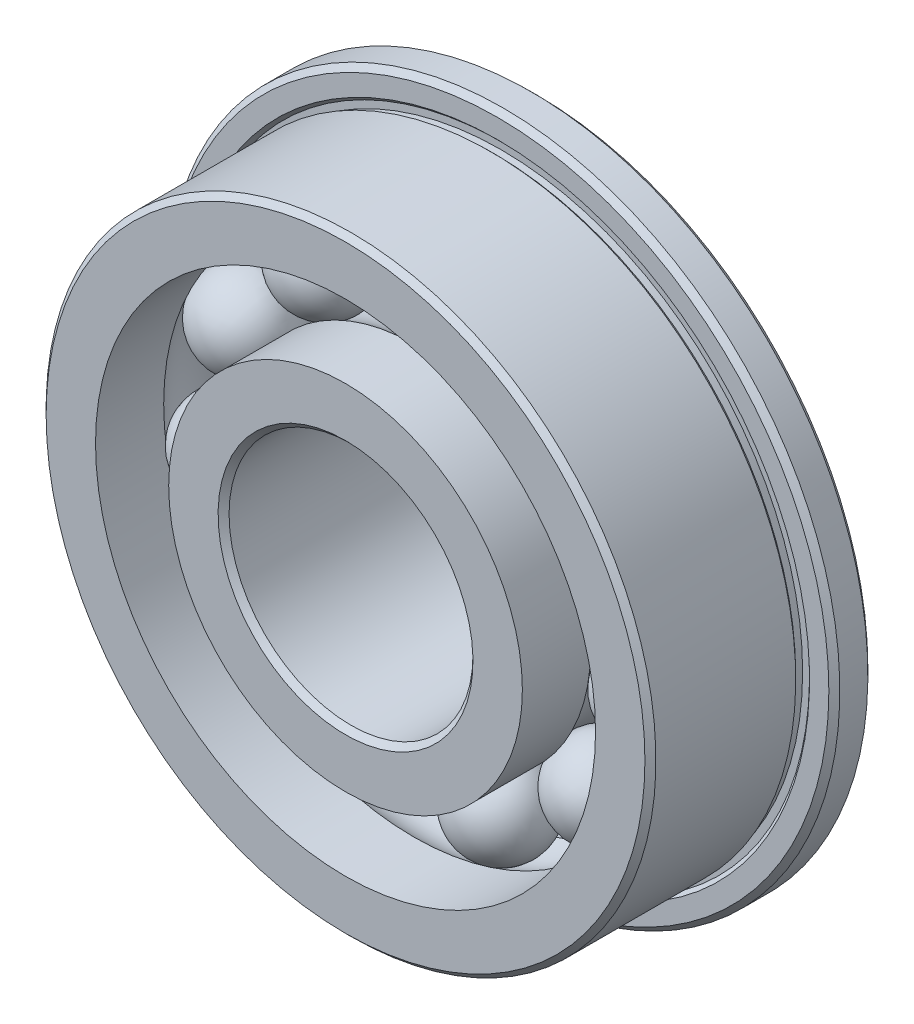
ISO-10303-21;
HEADER;
FILE_DESCRIPTION(('STEP AP214'),'2;1');
FILE_NAME('part.step','',(''),(''),'','','');
FILE_SCHEMA(('AUTOMOTIVE_DESIGN { 1 0 10303 214 1 1 1 1 }'));
ENDSEC;
DATA;
#1=APPLICATION_CONTEXT('core data for automotive mechanical design processes');
#2=APPLICATION_PROTOCOL_DEFINITION('international standard','automotive_design',2000,#1);
#3=PRODUCT_CONTEXT('',#1,'mechanical');
#4=PRODUCT('Part','Part','',(#3));
#5=PRODUCT_RELATED_PRODUCT_CATEGORY('part','',(#4));
#6=PRODUCT_DEFINITION_FORMATION('','',#4);
#7=PRODUCT_DEFINITION_CONTEXT('part definition',#1,'design');
#8=PRODUCT_DEFINITION('design','',#6,#7);
#9=PRODUCT_DEFINITION_SHAPE('','',#8);
#10=(LENGTH_UNIT() NAMED_UNIT(*) SI_UNIT(.MILLI.,.METRE.));
#11=(NAMED_UNIT(*) PLANE_ANGLE_UNIT() SI_UNIT($,.RADIAN.));
#12=(NAMED_UNIT(*) SI_UNIT($,.STERADIAN.) SOLID_ANGLE_UNIT());
#13=UNCERTAINTY_MEASURE_WITH_UNIT(LENGTH_MEASURE(1.E-05),#10,'distance_accuracy_value','');
#14=(GEOMETRIC_REPRESENTATION_CONTEXT(3) GLOBAL_UNCERTAINTY_ASSIGNED_CONTEXT((#13)) GLOBAL_UNIT_ASSIGNED_CONTEXT((#10,
#11,#12)) REPRESENTATION_CONTEXT('',''));
#15=CARTESIAN_POINT('',(0.,0.,0.));
#16=DIRECTION('',(0.,0.,1.));
#17=DIRECTION('',(1.,0.,0.));
#18=AXIS2_PLACEMENT_3D('',#15,#16,#17);
#19=CARTESIAN_POINT('',(-3.0039355419876,4.67421494179329,0.));
#20=DIRECTION('',(-0.540640817455586,0.841253532831188,0.));
#21=DIRECTION('',(0.841253532831188,0.540640817455586,0.));
#22=AXIS2_PLACEMENT_3D('',#19,#20,#21);
#23=SPHERICAL_SURFACE('',#22,1.190625);
#24=CARTESIAN_POINT('',(-3.64763601527066,5.67583242932043,0.));
#25=VERTEX_POINT('',#24);
#26=VERTEX_LOOP('',#25);
#27=FACE_BOUND('',#26,.T.);
#28=ADVANCED_FACE('F39',(#27),#23,.T.);
#29=CLOSED_SHELL('',(#28));
#30=MANIFOLD_SOLID_BREP('B2',#29);
#31=CARTESIAN_POINT('',(-5.05414277418852,2.30814966599179,0.));
#32=DIRECTION('',(-0.909631995354513,0.415415013001897,0.));
#33=DIRECTION('',(0.415415013001897,0.909631995354513,0.));
#34=AXIS2_PLACEMENT_3D('',#31,#32,#33);
#35=SPHERICAL_SURFACE('',#34,1.190625);
#36=CARTESIAN_POINT('',(-6.13717336865748,2.80275316584718,0.));
#37=VERTEX_POINT('',#36);
#38=VERTEX_LOOP('',#37);
#39=FACE_BOUND('',#38,.T.);
#40=ADVANCED_FACE('F57',(#39),#35,.T.);
#41=CLOSED_SHELL('',(#40));
#42=MANIFOLD_SOLID_BREP('B7',#41);
#43=CARTESIAN_POINT('',(-5.49969538645094,-0.790736820155883,0.));
#44=DIRECTION('',(-0.989821441880934,-0.142314838273275,0.));
#45=DIRECTION('',(-0.142314838273275,0.989821441880934,0.));
#46=AXIS2_PLACEMENT_3D('',#43,#44,#45);
#47=SPHERICAL_SURFACE('',#46,1.190625);
#48=CARTESIAN_POINT('',(-6.67820154069043,-0.960180424475,0.));
#49=VERTEX_POINT('',#48);
#50=VERTEX_LOOP('',#49);
#51=FACE_BOUND('',#50,.T.);
#52=ADVANCED_FACE('F75',(#51),#47,.T.);
#53=CLOSED_SHELL('',(#52));
#54=MANIFOLD_SOLID_BREP('B35',#53);
#55=CARTESIAN_POINT('',(-4.19913357250588,-3.63856995298345,0.));
#56=DIRECTION('',(-0.755749574354264,-0.654860733945278,0.));
#57=DIRECTION('',(-0.654860733945278,0.755749574354264,0.));
#58=AXIS2_PLACEMENT_3D('',#55,#56,#57);
#59=SPHERICAL_SURFACE('',#58,1.190625);
#60=CARTESIAN_POINT('',(-5.09894790947143,-4.41826351433705,0.));
#61=VERTEX_POINT('',#60);
#62=VERTEX_LOOP('',#61);
#63=FACE_BOUND('',#62,.T.);
#64=ADVANCED_FACE('F93',(#63),#59,.T.);
#65=CLOSED_SHELL('',(#64));
#66=MANIFOLD_SOLID_BREP('B53',#65);
#67=CARTESIAN_POINT('',(-1.56537651895024,-5.33118283464554,0.));
#68=DIRECTION('',(-0.281732556841437,-0.959492973614495,0.));
#69=DIRECTION('',(-0.959492973614495,0.281732556841437,0.));
#70=AXIS2_PLACEMENT_3D('',#67,#68,#69);
#71=SPHERICAL_SURFACE('',#70,1.190625);
#72=CARTESIAN_POINT('',(-1.90081434443957,-6.4735791563553,0.));
#73=VERTEX_POINT('',#72);
#74=VERTEX_LOOP('',#73);
#75=FACE_BOUND('',#74,.T.);
#76=ADVANCED_FACE('F111',(#75),#71,.T.);
#77=CLOSED_SHELL('',(#76));
#78=MANIFOLD_SOLID_BREP('B71',#77);
#79=CARTESIAN_POINT('',(1.56537651895016,-5.33118283464556,0.));
#80=DIRECTION('',(0.281732556841423,-0.959492973614499,0.));
#81=DIRECTION('',(-0.959492973614499,-0.281732556841423,0.));
#82=AXIS2_PLACEMENT_3D('',#79,#80,#81);
#83=SPHERICAL_SURFACE('',#82,1.190625);
#84=CARTESIAN_POINT('',(1.90081434443948,-6.47357915635533,0.));
#85=VERTEX_POINT('',#84);
#86=VERTEX_LOOP('',#85);
#87=FACE_BOUND('',#86,.T.);
#88=ADVANCED_FACE('F129',(#87),#83,.T.);
#89=CLOSED_SHELL('',(#88));
#90=MANIFOLD_SOLID_BREP('B89',#89);
#91=CARTESIAN_POINT('',(4.19913357250583,-3.63856995298351,0.));
#92=DIRECTION('',(0.755749574354255,-0.654860733945289,0.));
#93=DIRECTION('',(-0.654860733945289,-0.755749574354255,0.));
#94=AXIS2_PLACEMENT_3D('',#91,#92,#93);
#95=SPHERICAL_SURFACE('',#94,1.190625);
#96=CARTESIAN_POINT('',(5.09894790947136,-4.41826351433712,0.));
#97=VERTEX_POINT('',#96);
#98=VERTEX_LOOP('',#97);
#99=FACE_BOUND('',#98,.T.);
#100=ADVANCED_FACE('F147',(#99),#95,.T.);
#101=CLOSED_SHELL('',(#100));
#102=MANIFOLD_SOLID_BREP('B107',#101);
#103=CARTESIAN_POINT('',(5.49969538645093,-0.790736820155962,0.));
#104=DIRECTION('',(0.989821441880932,-0.142314838273289,0.));
#105=DIRECTION('',(-0.142314838273289,-0.989821441880932,0.));
#106=AXIS2_PLACEMENT_3D('',#103,#104,#105);
#107=SPHERICAL_SURFACE('',#106,1.190625);
#108=CARTESIAN_POINT('',(6.67820154069041,-0.960180424475096,0.));
#109=VERTEX_POINT('',#108);
#110=VERTEX_LOOP('',#109);
#111=FACE_BOUND('',#110,.T.);
#112=ADVANCED_FACE('F165',(#111),#107,.T.);
#113=CLOSED_SHELL('',(#112));
#114=MANIFOLD_SOLID_BREP('B125',#113);
#115=CARTESIAN_POINT('',(5.05414277418855,2.30814966599172,0.));
#116=DIRECTION('',(0.909631995354519,0.415415013001884,0.));
#117=DIRECTION('',(0.415415013001884,-0.909631995354519,0.));
#118=AXIS2_PLACEMENT_3D('',#115,#116,#117);
#119=SPHERICAL_SURFACE('',#118,1.190625);
#120=CARTESIAN_POINT('',(6.13717336865752,2.80275316584709,0.));
#121=VERTEX_POINT('',#120);
#122=VERTEX_LOOP('',#121);
#123=FACE_BOUND('',#122,.T.);
#124=ADVANCED_FACE('F183',(#123),#119,.T.);
#125=CLOSED_SHELL('',(#124));
#126=MANIFOLD_SOLID_BREP('B143',#125);
#127=CARTESIAN_POINT('',(3.00393554198767,4.67421494179325,0.));
#128=DIRECTION('',(0.540640817455599,0.841253532831181,0.));
#129=DIRECTION('',(0.841253532831181,-0.540640817455599,0.));
#130=AXIS2_PLACEMENT_3D('',#127,#128,#129);
#131=SPHERICAL_SURFACE('',#130,1.190625);
#132=CARTESIAN_POINT('',(3.64763601527074,5.67583242932037,0.));
#133=VERTEX_POINT('',#132);
#134=VERTEX_LOOP('',#133);
#135=FACE_BOUND('',#134,.T.);
#136=ADVANCED_FACE('F201',(#135),#131,.T.);
#137=CLOSED_SHELL('',(#136));
#138=MANIFOLD_SOLID_BREP('B161',#137);
#139=CARTESIAN_POINT('',(0.,5.55625,0.));
#140=DIRECTION('',(0.,1.,0.));
#141=DIRECTION('',(1.,0.,0.));
#142=AXIS2_PLACEMENT_3D('',#139,#140,#141);
#143=SPHERICAL_SURFACE('',#142,1.190625);
#144=CARTESIAN_POINT('',(0.,6.746875,0.));
#145=VERTEX_POINT('',#144);
#146=VERTEX_LOOP('',#145);
#147=FACE_BOUND('',#146,.T.);
#148=ADVANCED_FACE('F222',(#147),#143,.T.);
#149=CLOSED_SHELL('',(#148));
#150=MANIFOLD_SOLID_BREP('B179',#149);
#151=CARTESIAN_POINT('',(0.,0.,0.));
#152=DIRECTION('',(0.,0.,1.));
#153=DIRECTION('',(0.,-1.,0.));
#154=AXIS2_PLACEMENT_3D('',#151,#152,#153);
#155=CYLINDRICAL_SURFACE('',#154,4.60375);
#156=CARTESIAN_POINT('',(0.,0.,-0.714374999999998));
#157=DIRECTION('',(0.,0.,1.));
#158=DIRECTION('',(0.,-1.,0.));
#159=AXIS2_PLACEMENT_3D('',#156,#157,#158);
#160=CIRCLE('',#159,4.60375);
#161=CARTESIAN_POINT('',(0.,-4.60375,-0.714374999999999));
#162=VERTEX_POINT('',#161);
#163=EDGE_CURVE('E263',#162,#162,#160,.T.);
#164=ORIENTED_EDGE('',*,*,#163,.F.);
#165=EDGE_LOOP('',(#164));
#166=FACE_BOUND('',#165,.T.);
#167=CARTESIAN_POINT('',(0.,0.,-2.4892));
#168=DIRECTION('',(0.,0.,1.));
#169=DIRECTION('',(0.,-1.,0.));
#170=AXIS2_PLACEMENT_3D('',#167,#168,#169);
#171=CIRCLE('',#170,4.60375);
#172=CARTESIAN_POINT('',(0.,-4.60375,-2.4892));
#173=VERTEX_POINT('',#172);
#174=EDGE_CURVE('E272',#173,#173,#171,.T.);
#175=ORIENTED_EDGE('',*,*,#174,.T.);
#176=EDGE_LOOP('',(#175));
#177=FACE_BOUND('',#176,.T.);
#178=ADVANCED_FACE('F243',(#166,#177),#155,.T.);
#179=CARTESIAN_POINT('',(0.,0.,0.));
#180=DIRECTION('',(0.,0.,1.));
#181=DIRECTION('',(0.,-1.,0.));
#182=AXIS2_PLACEMENT_3D('',#179,#180,#181);
#183=TOROIDAL_SURFACE('',#182,5.55625,1.190625);
#184=CARTESIAN_POINT('',(0.,0.,0.714374999999999));
#185=DIRECTION('',(0.,0.,1.));
#186=DIRECTION('',(0.,-1.,0.));
#187=AXIS2_PLACEMENT_3D('',#184,#185,#186);
#188=CIRCLE('',#187,4.60375);
#189=CARTESIAN_POINT('',(0.,-4.60375,0.714374999999998));
#190=VERTEX_POINT('',#189);
#191=EDGE_CURVE('E266',#190,#190,#188,.T.);
#192=ORIENTED_EDGE('',*,*,#191,.F.);
#193=EDGE_LOOP('',(#192));
#194=FACE_BOUND('',#193,.T.);
#195=ORIENTED_EDGE('',*,*,#163,.T.);
#196=EDGE_LOOP('',(#195));
#197=FACE_BOUND('',#196,.T.);
#198=ADVANCED_FACE('F291',(#194,#197),#183,.F.);
#199=CARTESIAN_POINT('',(0.,0.,0.));
#200=DIRECTION('',(0.,0.,1.));
#201=DIRECTION('',(0.,-1.,0.));
#202=AXIS2_PLACEMENT_3D('',#199,#200,#201);
#203=CYLINDRICAL_SURFACE('',#202,4.60375);
#204=CARTESIAN_POINT('',(0.,0.,2.4892));
#205=DIRECTION('',(0.,0.,1.));
#206=DIRECTION('',(0.,-1.,0.));
#207=AXIS2_PLACEMENT_3D('',#204,#205,#206);
#208=CIRCLE('',#207,4.60375);
#209=CARTESIAN_POINT('',(0.,-4.60375,2.4892));
#210=VERTEX_POINT('',#209);
#211=EDGE_CURVE('E269',#210,#210,#208,.T.);
#212=ORIENTED_EDGE('',*,*,#211,.F.);
#213=EDGE_LOOP('',(#212));
#214=FACE_BOUND('',#213,.T.);
#215=ORIENTED_EDGE('',*,*,#191,.T.);
#216=EDGE_LOOP('',(#215));
#217=FACE_BOUND('',#216,.T.);
#218=ADVANCED_FACE('F297',(#214,#217),#203,.T.);
#219=CARTESIAN_POINT('',(0.,3.175,2.4892));
#220=DIRECTION('',(0.,0.,-1.));
#221=DIRECTION('',(0.,1.,0.));
#222=AXIS2_PLACEMENT_3D('',#219,#220,#221);
#223=PLANE('',#222);
#224=CARTESIAN_POINT('',(0.,0.,2.4892));
#225=DIRECTION('',(0.,0.,-1.));
#226=DIRECTION('',(0.,1.,0.));
#227=AXIS2_PLACEMENT_3D('',#224,#225,#226);
#228=CIRCLE('',#227,3.317875);
#229=CARTESIAN_POINT('',(0.,3.317875,2.4892));
#230=VERTEX_POINT('',#229);
#231=EDGE_CURVE('E221',#230,#230,#228,.T.);
#232=ORIENTED_EDGE('',*,*,#231,.T.);
#233=EDGE_LOOP('',(#232));
#234=FACE_BOUND('',#233,.T.);
#235=ORIENTED_EDGE('',*,*,#211,.T.);
#236=EDGE_LOOP('',(#235));
#237=FACE_BOUND('',#236,.T.);
#238=ADVANCED_FACE('F288',(#234,#237),#223,.F.);
#239=CARTESIAN_POINT('',(0.,0.,0.));
#240=DIRECTION('',(0.,0.,1.));
#241=DIRECTION('',(0.,-1.,0.));
#242=AXIS2_PLACEMENT_3D('',#239,#240,#241);
#243=CYLINDRICAL_SURFACE('',#242,3.175);
#244=CARTESIAN_POINT('',(0.,0.,-2.346325));
#245=DIRECTION('',(0.,0.,1.));
#246=DIRECTION('',(0.,-1.,0.));
#247=AXIS2_PLACEMENT_3D('',#244,#245,#246);
#248=CIRCLE('',#247,3.175);
#249=CARTESIAN_POINT('',(0.,-3.175,-2.346325));
#250=VERTEX_POINT('',#249);
#251=EDGE_CURVE('E250',#250,#250,#248,.F.);
#252=ORIENTED_EDGE('',*,*,#251,.T.);
#253=EDGE_LOOP('',(#252));
#254=FACE_BOUND('',#253,.T.);
#255=CARTESIAN_POINT('',(0.,0.,2.346325));
#256=DIRECTION('',(0.,0.,-1.));
#257=DIRECTION('',(0.,1.,0.));
#258=AXIS2_PLACEMENT_3D('',#255,#256,#257);
#259=CIRCLE('',#258,3.175);
#260=CARTESIAN_POINT('',(0.,3.175,2.346325));
#261=VERTEX_POINT('',#260);
#262=EDGE_CURVE('E254',#261,#261,#259,.F.);
#263=ORIENTED_EDGE('',*,*,#262,.T.);
#264=EDGE_LOOP('',(#263));
#265=FACE_BOUND('',#264,.T.);
#266=ADVANCED_FACE('F280',(#254,#265),#243,.F.);
#267=CARTESIAN_POINT('',(0.,4.60375,-2.4892));
#268=DIRECTION('',(0.,0.,1.));
#269=DIRECTION('',(0.,-1.,0.));
#270=AXIS2_PLACEMENT_3D('',#267,#268,#269);
#271=PLANE('',#270);
#272=CARTESIAN_POINT('',(0.,0.,-2.4892));
#273=DIRECTION('',(0.,0.,1.));
#274=DIRECTION('',(0.,-1.,0.));
#275=AXIS2_PLACEMENT_3D('',#272,#273,#274);
#276=CIRCLE('',#275,3.317875);
#277=CARTESIAN_POINT('',(0.,-3.317875,-2.4892));
#278=VERTEX_POINT('',#277);
#279=EDGE_CURVE('E258',#278,#278,#276,.T.);
#280=ORIENTED_EDGE('',*,*,#279,.T.);
#281=EDGE_LOOP('',(#280));
#282=FACE_BOUND('',#281,.T.);
#283=ORIENTED_EDGE('',*,*,#174,.F.);
#284=EDGE_LOOP('',(#283));
#285=FACE_BOUND('',#284,.T.);
#286=ADVANCED_FACE('F277',(#282,#285),#271,.F.);
#287=CARTESIAN_POINT('',(0.,0.,-2.4892));
#288=DIRECTION('',(0.,0.,-1.));
#289=DIRECTION('',(0.,1.,0.));
#290=AXIS2_PLACEMENT_3D('',#287,#288,#289);
#291=CONICAL_SURFACE('',#290,3.317875,0.785398163397448);
#292=ORIENTED_EDGE('',*,*,#251,.F.);
#293=EDGE_LOOP('',(#292));
#294=FACE_BOUND('',#293,.T.);
#295=ORIENTED_EDGE('',*,*,#279,.F.);
#296=EDGE_LOOP('',(#295));
#297=FACE_BOUND('',#296,.T.);
#298=ADVANCED_FACE('F279',(#294,#297),#291,.F.);
#299=CARTESIAN_POINT('',(0.,0.,2.346325));
#300=DIRECTION('',(0.,0.,1.));
#301=DIRECTION('',(0.,-1.,0.));
#302=AXIS2_PLACEMENT_3D('',#299,#300,#301);
#303=CONICAL_SURFACE('',#302,3.175,0.78539816339745);
#304=ORIENTED_EDGE('',*,*,#231,.F.);
#305=EDGE_LOOP('',(#304));
#306=FACE_BOUND('',#305,.T.);
#307=ORIENTED_EDGE('',*,*,#262,.F.);
#308=EDGE_LOOP('',(#307));
#309=FACE_BOUND('',#308,.T.);
#310=ADVANCED_FACE('F245',(#306,#309),#303,.F.);
#311=CLOSED_SHELL('',(#178,#198,#218,#238,#266,#286,#298,#310));
#312=MANIFOLD_SOLID_BREP('B197',#311);
#313=CARTESIAN_POINT('',(0.,6.50875,-2.4892));
#314=DIRECTION('',(0.,0.,1.));
#315=DIRECTION('',(0.,-1.,0.));
#316=AXIS2_PLACEMENT_3D('',#313,#314,#315);
#317=PLANE('',#316);
#318=CARTESIAN_POINT('',(0.,0.,-2.4892));
#319=DIRECTION('',(0.,0.,1.));
#320=DIRECTION('',(0.,-1.,0.));
#321=AXIS2_PLACEMENT_3D('',#318,#319,#320);
#322=CIRCLE('',#321,8.620125);
#323=CARTESIAN_POINT('',(0.,-8.620125,-2.4892));
#324=VERTEX_POINT('',#323);
#325=EDGE_CURVE('E380',#324,#324,#322,.F.);
#326=ORIENTED_EDGE('',*,*,#325,.T.);
#327=EDGE_LOOP('',(#326));
#328=FACE_BOUND('',#327,.T.);
#329=CARTESIAN_POINT('',(0.,0.,-2.4892));
#330=DIRECTION('',(0.,0.,1.));
#331=DIRECTION('',(0.,-1.,0.));
#332=AXIS2_PLACEMENT_3D('',#329,#330,#331);
#333=CIRCLE('',#332,6.50875);
#334=CARTESIAN_POINT('',(0.,-6.50875,-2.4892));
#335=VERTEX_POINT('',#334);
#336=EDGE_CURVE('E391',#335,#335,#333,.T.);
#337=ORIENTED_EDGE('',*,*,#336,.T.);
#338=EDGE_LOOP('',(#337));
#339=FACE_BOUND('',#338,.T.);
#340=ADVANCED_FACE('F365',(#328,#339),#317,.F.);
#341=CARTESIAN_POINT('',(0.,0.,0.));
#342=DIRECTION('',(0.,0.,1.));
#343=DIRECTION('',(0.,-1.,0.));
#344=AXIS2_PLACEMENT_3D('',#341,#342,#343);
#345=CYLINDRICAL_SURFACE('',#344,6.50875);
#346=ORIENTED_EDGE('',*,*,#336,.F.);
#347=EDGE_LOOP('',(#346));
#348=FACE_BOUND('',#347,.T.);
#349=CARTESIAN_POINT('',(0.,0.,-0.714374999999999));
#350=DIRECTION('',(0.,0.,1.));
#351=DIRECTION('',(0.,-1.,0.));
#352=AXIS2_PLACEMENT_3D('',#349,#350,#351);
#353=CIRCLE('',#352,6.50875);
#354=CARTESIAN_POINT('',(0.,-6.50875,-0.714374999999999));
#355=VERTEX_POINT('',#354);
#356=EDGE_CURVE('E394',#355,#355,#353,.T.);
#357=ORIENTED_EDGE('',*,*,#356,.T.);
#358=EDGE_LOOP('',(#357));
#359=FACE_BOUND('',#358,.T.);
#360=ADVANCED_FACE('F437',(#348,#359),#345,.F.);
#361=CARTESIAN_POINT('',(0.,0.,0.));
#362=DIRECTION('',(0.,0.,1.));
#363=DIRECTION('',(0.,-1.,0.));
#364=AXIS2_PLACEMENT_3D('',#361,#362,#363);
#365=TOROIDAL_SURFACE('',#364,5.55625,1.190625);
#366=ORIENTED_EDGE('',*,*,#356,.F.);
#367=EDGE_LOOP('',(#366));
#368=FACE_BOUND('',#367,.T.);
#369=CARTESIAN_POINT('',(0.,0.,0.714374999999999));
#370=DIRECTION('',(0.,0.,1.));
#371=DIRECTION('',(0.,-1.,0.));
#372=AXIS2_PLACEMENT_3D('',#369,#370,#371);
#373=CIRCLE('',#372,6.50875);
#374=CARTESIAN_POINT('',(0.,-6.50875,0.714374999999998));
#375=VERTEX_POINT('',#374);
#376=EDGE_CURVE('E397',#375,#375,#373,.T.);
#377=ORIENTED_EDGE('',*,*,#376,.T.);
#378=EDGE_LOOP('',(#377));
#379=FACE_BOUND('',#378,.T.);
#380=ADVANCED_FACE('F443',(#368,#379),#365,.F.);
#381=CARTESIAN_POINT('',(0.,0.,0.));
#382=DIRECTION('',(0.,0.,1.));
#383=DIRECTION('',(0.,-1.,0.));
#384=AXIS2_PLACEMENT_3D('',#381,#382,#383);
#385=CYLINDRICAL_SURFACE('',#384,6.50875);
#386=ORIENTED_EDGE('',*,*,#376,.F.);
#387=EDGE_LOOP('',(#386));
#388=FACE_BOUND('',#387,.T.);
#389=CARTESIAN_POINT('',(0.,0.,2.4892));
#390=DIRECTION('',(0.,0.,1.));
#391=DIRECTION('',(0.,-1.,0.));
#392=AXIS2_PLACEMENT_3D('',#389,#390,#391);
#393=CIRCLE('',#392,6.50875);
#394=CARTESIAN_POINT('',(0.,-6.50875,2.4892));
#395=VERTEX_POINT('',#394);
#396=EDGE_CURVE('E400',#395,#395,#393,.T.);
#397=ORIENTED_EDGE('',*,*,#396,.T.);
#398=EDGE_LOOP('',(#397));
#399=FACE_BOUND('',#398,.T.);
#400=ADVANCED_FACE('F507',(#388,#399),#385,.F.);
#401=CARTESIAN_POINT('',(0.,7.9375,2.4892));
#402=DIRECTION('',(0.,0.,-1.));
#403=DIRECTION('',(0.,1.,0.));
#404=AXIS2_PLACEMENT_3D('',#401,#402,#403);
#405=PLANE('',#404);
#406=CARTESIAN_POINT('',(0.,0.,2.4892));
#407=DIRECTION('',(0.,0.,-1.));
#408=DIRECTION('',(0.,1.,0.));
#409=AXIS2_PLACEMENT_3D('',#406,#407,#408);
#410=CIRCLE('',#409,7.794625);
#411=CARTESIAN_POINT('',(0.,7.794625,2.4892));
#412=VERTEX_POINT('',#411);
#413=EDGE_CURVE('E372',#412,#412,#410,.F.);
#414=ORIENTED_EDGE('',*,*,#413,.T.);
#415=EDGE_LOOP('',(#414));
#416=FACE_BOUND('',#415,.T.);
#417=ORIENTED_EDGE('',*,*,#396,.F.);
#418=EDGE_LOOP('',(#417));
#419=FACE_BOUND('',#418,.T.);
#420=ADVANCED_FACE('F497',(#416,#419),#405,.F.);
#421=CARTESIAN_POINT('',(0.,0.,0.));
#422=DIRECTION('',(0.,0.,1.));
#423=DIRECTION('',(0.,-1.,0.));
#424=AXIS2_PLACEMENT_3D('',#421,#422,#423);
#425=CYLINDRICAL_SURFACE('',#424,7.9375);
#426=CARTESIAN_POINT('',(0.,0.,2.346325));
#427=DIRECTION('',(0.,0.,-1.));
#428=DIRECTION('',(0.,1.,0.));
#429=AXIS2_PLACEMENT_3D('',#426,#427,#428);
#430=CIRCLE('',#429,7.9375);
#431=CARTESIAN_POINT('',(0.,7.9375,2.346325));
#432=VERTEX_POINT('',#431);
#433=EDGE_CURVE('E242',#432,#432,#430,.T.);
#434=ORIENTED_EDGE('',*,*,#433,.T.);
#435=EDGE_LOOP('',(#434));
#436=FACE_BOUND('',#435,.T.);
#437=CARTESIAN_POINT('',(0.,0.,-1.29359487757862));
#438=DIRECTION('',(0.,0.,1.));
#439=DIRECTION('',(0.,-1.,0.));
#440=AXIS2_PLACEMENT_3D('',#437,#438,#439);
#441=CIRCLE('',#440,7.9375);
#442=CARTESIAN_POINT('',(0.,-7.9375,-1.29359487757862));
#443=VERTEX_POINT('',#442);
#444=EDGE_CURVE('E403',#443,#443,#441,.T.);
#445=ORIENTED_EDGE('',*,*,#444,.T.);
#446=EDGE_LOOP('',(#445));
#447=FACE_BOUND('',#446,.T.);
#448=ADVANCED_FACE('F491',(#436,#447),#425,.T.);
#449=CARTESIAN_POINT('',(0.,0.,-1.38339743878931));
#450=DIRECTION('',(0.,0.,1.));
#451=DIRECTION('',(0.,-1.,0.));
#452=AXIS2_PLACEMENT_3D('',#449,#450,#451);
#453=CONICAL_SURFACE('',#452,7.84769743878931,0.785398163397442);
#454=ORIENTED_EDGE('',*,*,#444,.F.);
#455=EDGE_LOOP('',(#454));
#456=FACE_BOUND('',#455,.T.);
#457=CARTESIAN_POINT('',(0.,0.,-1.38339743878931));
#458=DIRECTION('',(0.,0.,1.));
#459=DIRECTION('',(0.,-1.,0.));
#460=AXIS2_PLACEMENT_3D('',#457,#458,#459);
#461=CIRCLE('',#460,7.84769743878931);
#462=CARTESIAN_POINT('',(0.,-7.84769743878931,-1.38339743878931));
#463=VERTEX_POINT('',#462);
#464=EDGE_CURVE('E406',#463,#463,#461,.T.);
#465=ORIENTED_EDGE('',*,*,#464,.T.);
#466=EDGE_LOOP('',(#465));
#467=FACE_BOUND('',#466,.T.);
#468=ADVANCED_FACE('F496',(#456,#467),#453,.T.);
#469=CARTESIAN_POINT('',(0.,0.,0.));
#470=DIRECTION('',(0.,0.,1.));
#471=DIRECTION('',(0.,-1.,0.));
#472=AXIS2_PLACEMENT_3D('',#469,#470,#471);
#473=CYLINDRICAL_SURFACE('',#472,7.84769743878931);
#474=ORIENTED_EDGE('',*,*,#464,.F.);
#475=EDGE_LOOP('',(#474));
#476=FACE_BOUND('',#475,.T.);
#477=CARTESIAN_POINT('',(0.,0.,-1.56300256121069));
#478=DIRECTION('',(0.,0.,1.));
#479=DIRECTION('',(0.,-1.,0.));
#480=AXIS2_PLACEMENT_3D('',#477,#478,#479);
#481=CIRCLE('',#480,7.84769743878931);
#482=CARTESIAN_POINT('',(0.,-7.84769743878931,-1.5630025612107));
#483=VERTEX_POINT('',#482);
#484=EDGE_CURVE('E409',#483,#483,#481,.T.);
#485=ORIENTED_EDGE('',*,*,#484,.T.);
#486=EDGE_LOOP('',(#485));
#487=FACE_BOUND('',#486,.T.);
#488=ADVANCED_FACE('F529',(#476,#487),#473,.T.);
#489=CARTESIAN_POINT('',(0.,8.02730256121069,-1.56300256121069));
#490=DIRECTION('',(0.,0.,-1.));
#491=DIRECTION('',(0.,1.,0.));
#492=AXIS2_PLACEMENT_3D('',#489,#490,#491);
#493=PLANE('',#492);
#494=ORIENTED_EDGE('',*,*,#484,.F.);
#495=EDGE_LOOP('',(#494));
#496=FACE_BOUND('',#495,.T.);
#497=CARTESIAN_POINT('',(0.,0.,-1.56300256121069));
#498=DIRECTION('',(0.,0.,1.));
#499=DIRECTION('',(0.,-1.,0.));
#500=AXIS2_PLACEMENT_3D('',#497,#498,#499);
#501=CIRCLE('',#500,8.02730256121069);
#502=CARTESIAN_POINT('',(0.,-8.02730256121069,-1.56300256121069));
#503=VERTEX_POINT('',#502);
#504=EDGE_CURVE('E412',#503,#503,#501,.T.);
#505=ORIENTED_EDGE('',*,*,#504,.T.);
#506=EDGE_LOOP('',(#505));
#507=FACE_BOUND('',#506,.T.);
#508=ADVANCED_FACE('F433',(#496,#507),#493,.F.);
#509=CARTESIAN_POINT('',(0.,0.,-1.4732));
#510=DIRECTION('',(0.,0.,1.));
#511=DIRECTION('',(0.,-1.,0.));
#512=AXIS2_PLACEMENT_3D('',#509,#510,#511);
#513=CONICAL_SURFACE('',#512,8.11710512242138,0.785398163397445);
#514=ORIENTED_EDGE('',*,*,#504,.F.);
#515=EDGE_LOOP('',(#514));
#516=FACE_BOUND('',#515,.T.);
#517=CARTESIAN_POINT('',(0.,0.,-1.4732));
#518=DIRECTION('',(0.,0.,1.));
#519=DIRECTION('',(0.,-1.,0.));
#520=AXIS2_PLACEMENT_3D('',#517,#518,#519);
#521=CIRCLE('',#520,8.11710512242138);
#522=CARTESIAN_POINT('',(0.,-8.11710512242138,-1.4732));
#523=VERTEX_POINT('',#522);
#524=EDGE_CURVE('E415',#523,#523,#521,.T.);
#525=ORIENTED_EDGE('',*,*,#524,.T.);
#526=EDGE_LOOP('',(#525));
#527=FACE_BOUND('',#526,.T.);
#528=ADVANCED_FACE('F419',(#516,#527),#513,.F.);
#529=CARTESIAN_POINT('',(0.,8.763,-1.4732));
#530=DIRECTION('',(0.,0.,-1.));
#531=DIRECTION('',(0.,1.,0.));
#532=AXIS2_PLACEMENT_3D('',#529,#530,#531);
#533=PLANE('',#532);
#534=CARTESIAN_POINT('',(0.,0.,-1.4732));
#535=DIRECTION('',(0.,0.,-1.));
#536=DIRECTION('',(0.,1.,0.));
#537=AXIS2_PLACEMENT_3D('',#534,#535,#536);
#538=CIRCLE('',#537,8.620125);
#539=CARTESIAN_POINT('',(0.,8.620125,-1.4732));
#540=VERTEX_POINT('',#539);
#541=EDGE_CURVE('E376',#540,#540,#538,.F.);
#542=ORIENTED_EDGE('',*,*,#541,.T.);
#543=EDGE_LOOP('',(#542));
#544=FACE_BOUND('',#543,.T.);
#545=ORIENTED_EDGE('',*,*,#524,.F.);
#546=EDGE_LOOP('',(#545));
#547=FACE_BOUND('',#546,.T.);
#548=ADVANCED_FACE('F421',(#544,#547),#533,.F.);
#549=CARTESIAN_POINT('',(0.,0.,0.));
#550=DIRECTION('',(0.,0.,1.));
#551=DIRECTION('',(0.,-1.,0.));
#552=AXIS2_PLACEMENT_3D('',#549,#550,#551);
#553=CYLINDRICAL_SURFACE('',#552,8.763);
#554=CARTESIAN_POINT('',(0.,0.,-2.346325));
#555=DIRECTION('',(0.,0.,1.));
#556=DIRECTION('',(0.,-1.,0.));
#557=AXIS2_PLACEMENT_3D('',#554,#555,#556);
#558=CIRCLE('',#557,8.763);
#559=CARTESIAN_POINT('',(0.,-8.763,-2.346325));
#560=VERTEX_POINT('',#559);
#561=EDGE_CURVE('E385',#560,#560,#558,.T.);
#562=ORIENTED_EDGE('',*,*,#561,.T.);
#563=EDGE_LOOP('',(#562));
#564=FACE_BOUND('',#563,.T.);
#565=CARTESIAN_POINT('',(0.,0.,-1.616075));
#566=DIRECTION('',(0.,0.,-1.));
#567=DIRECTION('',(0.,1.,0.));
#568=AXIS2_PLACEMENT_3D('',#565,#566,#567);
#569=CIRCLE('',#568,8.763);
#570=CARTESIAN_POINT('',(0.,8.763,-1.616075));
#571=VERTEX_POINT('',#570);
#572=EDGE_CURVE('E388',#571,#571,#569,.T.);
#573=ORIENTED_EDGE('',*,*,#572,.T.);
#574=EDGE_LOOP('',(#573));
#575=FACE_BOUND('',#574,.T.);
#576=ADVANCED_FACE('F423',(#564,#575),#553,.T.);
#577=CARTESIAN_POINT('',(0.,0.,-2.346325));
#578=DIRECTION('',(0.,0.,1.));
#579=DIRECTION('',(0.,-1.,0.));
#580=AXIS2_PLACEMENT_3D('',#577,#578,#579);
#581=CONICAL_SURFACE('',#580,8.763,0.785398163397451);
#582=ORIENTED_EDGE('',*,*,#325,.F.);
#583=EDGE_LOOP('',(#582));
#584=FACE_BOUND('',#583,.T.);
#585=ORIENTED_EDGE('',*,*,#561,.F.);
#586=EDGE_LOOP('',(#585));
#587=FACE_BOUND('',#586,.T.);
#588=ADVANCED_FACE('F430',(#584,#587),#581,.T.);
#589=CARTESIAN_POINT('',(0.,0.,-1.4732));
#590=DIRECTION('',(0.,0.,-1.));
#591=DIRECTION('',(0.,1.,0.));
#592=AXIS2_PLACEMENT_3D('',#589,#590,#591);
#593=CONICAL_SURFACE('',#592,8.620125,0.785398163397451);
#594=ORIENTED_EDGE('',*,*,#572,.F.);
#595=EDGE_LOOP('',(#594));
#596=FACE_BOUND('',#595,.T.);
#597=ORIENTED_EDGE('',*,*,#541,.F.);
#598=EDGE_LOOP('',(#597));
#599=FACE_BOUND('',#598,.T.);
#600=ADVANCED_FACE('F450',(#596,#599),#593,.T.);
#601=CARTESIAN_POINT('',(0.,0.,2.4892));
#602=DIRECTION('',(0.,0.,-1.));
#603=DIRECTION('',(0.,1.,0.));
#604=AXIS2_PLACEMENT_3D('',#601,#602,#603);
#605=CONICAL_SURFACE('',#604,7.794625,0.785398163397448);
#606=ORIENTED_EDGE('',*,*,#433,.F.);
#607=EDGE_LOOP('',(#606));
#608=FACE_BOUND('',#607,.T.);
#609=ORIENTED_EDGE('',*,*,#413,.F.);
#610=EDGE_LOOP('',(#609));
#611=FACE_BOUND('',#610,.T.);
#612=ADVANCED_FACE('F367',(#608,#611),#605,.T.);
#613=CLOSED_SHELL('',(#340,#360,#380,#400,#420,#448,#468,#488,#508,#528,#548,#576,#588,#600,#612));
#614=MANIFOLD_SOLID_BREP('B216',#613);
#615=ADVANCED_BREP_SHAPE_REPRESENTATION('',(#18,#30,#42,#54,#66,#78,#90,#102,#114,#126,#138,
#150,#312,#614),#14);
#616=SHAPE_DEFINITION_REPRESENTATION(#9,#615);
ENDSEC;
END-ISO-10303-21;
